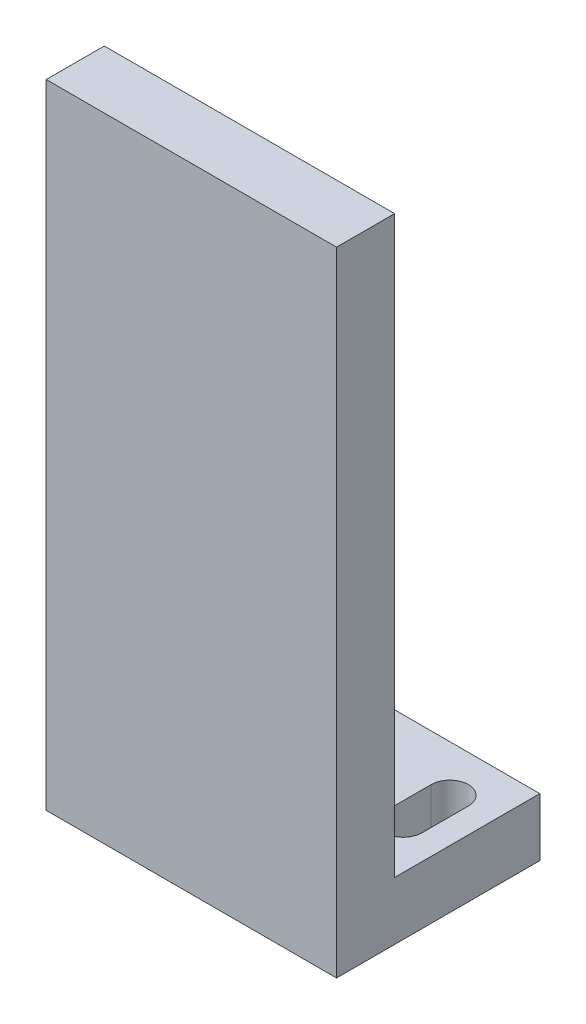
ISO-10303-21;
HEADER;
FILE_DESCRIPTION(('STEP AP214'),'2;1');
FILE_NAME('part.step','',(''),(''),'','','');
FILE_SCHEMA(('AUTOMOTIVE_DESIGN { 1 0 10303 214 1 1 1 1 }'));
ENDSEC;
DATA;
#1=APPLICATION_CONTEXT('core data for automotive mechanical design processes');
#2=APPLICATION_PROTOCOL_DEFINITION('international standard','automotive_design',2000,#1);
#3=PRODUCT_CONTEXT('',#1,'mechanical');
#4=PRODUCT('Part','Part','',(#3));
#5=PRODUCT_RELATED_PRODUCT_CATEGORY('part','',(#4));
#6=PRODUCT_DEFINITION_FORMATION('','',#4);
#7=PRODUCT_DEFINITION_CONTEXT('part definition',#1,'design');
#8=PRODUCT_DEFINITION('design','',#6,#7);
#9=PRODUCT_DEFINITION_SHAPE('','',#8);
#10=(LENGTH_UNIT() NAMED_UNIT(*) SI_UNIT(.MILLI.,.METRE.));
#11=(NAMED_UNIT(*) PLANE_ANGLE_UNIT() SI_UNIT($,.RADIAN.));
#12=(NAMED_UNIT(*) SI_UNIT($,.STERADIAN.) SOLID_ANGLE_UNIT());
#13=UNCERTAINTY_MEASURE_WITH_UNIT(LENGTH_MEASURE(1.E-05),#10,'distance_accuracy_value','');
#14=(GEOMETRIC_REPRESENTATION_CONTEXT(3) GLOBAL_UNCERTAINTY_ASSIGNED_CONTEXT((#13)) GLOBAL_UNIT_ASSIGNED_CONTEXT((#10,
#11,#12)) REPRESENTATION_CONTEXT('',''));
#15=CARTESIAN_POINT('',(0.,0.,0.));
#16=DIRECTION('',(0.,0.,1.));
#17=DIRECTION('',(1.,0.,0.));
#18=AXIS2_PLACEMENT_3D('',#15,#16,#17);
#19=CARTESIAN_POINT('',(25.,109.,-17.5));
#20=DIRECTION('',(0.,0.,1.));
#21=DIRECTION('',(1.,0.,0.));
#22=AXIS2_PLACEMENT_3D('',#19,#20,#21);
#23=PLANE('',#22);
#24=DIRECTION('',(1.,0.,0.));
#25=VECTOR('',#24,1.);
#26=CARTESIAN_POINT('',(-25.,9.99999999999999,-17.5));
#27=LINE('',#26,#25);
#28=CARTESIAN_POINT('',(-25.,9.99999999999999,-17.5));
#29=VERTEX_POINT('',#28);
#30=CARTESIAN_POINT('',(25.,9.99999999999999,-17.5));
#31=VERTEX_POINT('',#30);
#32=EDGE_CURVE('E209',#29,#31,#27,.T.);
#33=ORIENTED_EDGE('',*,*,#32,.T.);
#34=DIRECTION('',(0.,-1.,0.));
#35=VECTOR('',#34,1.);
#36=CARTESIAN_POINT('',(25.,109.,-17.5));
#37=LINE('',#36,#35);
#38=CARTESIAN_POINT('',(25.,0.,-17.5));
#39=VERTEX_POINT('',#38);
#40=EDGE_CURVE('E243',#31,#39,#37,.T.);
#41=ORIENTED_EDGE('',*,*,#40,.T.);
#42=DIRECTION('',(-1.,0.,0.));
#43=VECTOR('',#42,1.);
#44=CARTESIAN_POINT('',(25.,0.,-17.5));
#45=LINE('',#44,#43);
#46=CARTESIAN_POINT('',(-25.,0.,-17.5));
#47=VERTEX_POINT('',#46);
#48=EDGE_CURVE('E227',#39,#47,#45,.T.);
#49=ORIENTED_EDGE('',*,*,#48,.T.);
#50=DIRECTION('',(0.,-1.,0.));
#51=VECTOR('',#50,1.);
#52=CARTESIAN_POINT('',(-25.,109.,-17.5));
#53=LINE('',#52,#51);
#54=EDGE_CURVE('E232',#29,#47,#53,.T.);
#55=ORIENTED_EDGE('',*,*,#54,.F.);
#56=EDGE_LOOP('',(#33,#41,#49,#55));
#57=FACE_BOUND('',#56,.T.);
#58=ADVANCED_FACE('F36',(#57),#23,.F.);
#59=CARTESIAN_POINT('',(-25.,109.,17.5));
#60=DIRECTION('',(1.,0.,0.));
#61=DIRECTION('',(0.,0.,-1.));
#62=AXIS2_PLACEMENT_3D('',#59,#60,#61);
#63=PLANE('',#62);
#64=DIRECTION('',(0.,0.,1.));
#65=VECTOR('',#64,1.);
#66=CARTESIAN_POINT('',(-25.,109.,17.5));
#67=LINE('',#66,#65);
#68=CARTESIAN_POINT('',(-25.,109.,7.5));
#69=VERTEX_POINT('',#68);
#70=CARTESIAN_POINT('',(-25.,109.,17.5));
#71=VERTEX_POINT('',#70);
#72=EDGE_CURVE('E224',#69,#71,#67,.T.);
#73=ORIENTED_EDGE('',*,*,#72,.F.);
#74=DIRECTION('',(0.,1.,0.));
#75=VECTOR('',#74,1.);
#76=CARTESIAN_POINT('',(-25.,-55.9016994374947,7.5));
#77=LINE('',#76,#75);
#78=CARTESIAN_POINT('',(-25.,9.99999999999999,7.5));
#79=VERTEX_POINT('',#78);
#80=EDGE_CURVE('E218',#79,#69,#77,.T.);
#81=ORIENTED_EDGE('',*,*,#80,.F.);
#82=DIRECTION('',(0.,0.,-1.));
#83=VECTOR('',#82,1.);
#84=CARTESIAN_POINT('',(-25.,9.99999999999999,-17.5));
#85=LINE('',#84,#83);
#86=EDGE_CURVE('E213',#79,#29,#85,.T.);
#87=ORIENTED_EDGE('',*,*,#86,.T.);
#88=ORIENTED_EDGE('',*,*,#54,.T.);
#89=DIRECTION('',(0.,0.,1.));
#90=VECTOR('',#89,1.);
#91=CARTESIAN_POINT('',(-25.,0.,17.5));
#92=LINE('',#91,#90);
#93=CARTESIAN_POINT('',(-25.,0.,17.5));
#94=VERTEX_POINT('',#93);
#95=EDGE_CURVE('E223',#47,#94,#92,.T.);
#96=ORIENTED_EDGE('',*,*,#95,.T.);
#97=DIRECTION('',(0.,-1.,0.));
#98=VECTOR('',#97,1.);
#99=CARTESIAN_POINT('',(-25.,109.,17.5));
#100=LINE('',#99,#98);
#101=EDGE_CURVE('E12',#71,#94,#100,.T.);
#102=ORIENTED_EDGE('',*,*,#101,.F.);
#103=EDGE_LOOP('',(#73,#81,#87,#88,#96,#102));
#104=FACE_BOUND('',#103,.T.);
#105=ADVANCED_FACE('F38',(#104),#63,.F.);
#106=CARTESIAN_POINT('',(25.,109.,17.5));
#107=DIRECTION('',(0.,0.,-1.));
#108=DIRECTION('',(-1.,0.,0.));
#109=AXIS2_PLACEMENT_3D('',#106,#107,#108);
#110=PLANE('',#109);
#111=DIRECTION('',(1.,0.,0.));
#112=VECTOR('',#111,1.);
#113=CARTESIAN_POINT('',(25.,0.,17.5));
#114=LINE('',#113,#112);
#115=CARTESIAN_POINT('',(25.,0.,17.5));
#116=VERTEX_POINT('',#115);
#117=EDGE_CURVE('E235',#94,#116,#114,.T.);
#118=ORIENTED_EDGE('',*,*,#117,.T.);
#119=DIRECTION('',(0.,-1.,0.));
#120=VECTOR('',#119,1.);
#121=CARTESIAN_POINT('',(25.,109.,17.5));
#122=LINE('',#121,#120);
#123=CARTESIAN_POINT('',(25.,109.,17.5));
#124=VERTEX_POINT('',#123);
#125=EDGE_CURVE('E44',#124,#116,#122,.T.);
#126=ORIENTED_EDGE('',*,*,#125,.F.);
#127=DIRECTION('',(1.,0.,0.));
#128=VECTOR('',#127,1.);
#129=CARTESIAN_POINT('',(25.,109.,17.5));
#130=LINE('',#129,#128);
#131=EDGE_CURVE('E226',#71,#124,#130,.T.);
#132=ORIENTED_EDGE('',*,*,#131,.F.);
#133=ORIENTED_EDGE('',*,*,#101,.T.);
#134=EDGE_LOOP('',(#118,#126,#132,#133));
#135=FACE_BOUND('',#134,.T.);
#136=ADVANCED_FACE('F271',(#135),#110,.F.);
#137=CARTESIAN_POINT('',(25.,109.,17.5));
#138=DIRECTION('',(-1.,0.,0.));
#139=DIRECTION('',(0.,0.,1.));
#140=AXIS2_PLACEMENT_3D('',#137,#138,#139);
#141=PLANE('',#140);
#142=DIRECTION('',(0.,0.,1.));
#143=VECTOR('',#142,1.);
#144=CARTESIAN_POINT('',(25.,9.99999999999999,-17.5));
#145=LINE('',#144,#143);
#146=CARTESIAN_POINT('',(25.,9.99999999999997,7.50000000000001));
#147=VERTEX_POINT('',#146);
#148=EDGE_CURVE('E206',#31,#147,#145,.T.);
#149=ORIENTED_EDGE('',*,*,#148,.T.);
#150=DIRECTION('',(0.,1.,0.));
#151=VECTOR('',#150,1.);
#152=CARTESIAN_POINT('',(25.,-55.9016994374947,7.50000000000001));
#153=LINE('',#152,#151);
#154=CARTESIAN_POINT('',(25.,109.,7.50000000000001));
#155=VERTEX_POINT('',#154);
#156=EDGE_CURVE('E210',#147,#155,#153,.T.);
#157=ORIENTED_EDGE('',*,*,#156,.T.);
#158=DIRECTION('',(0.,0.,-1.));
#159=VECTOR('',#158,1.);
#160=CARTESIAN_POINT('',(25.,109.,17.5));
#161=LINE('',#160,#159);
#162=EDGE_CURVE('E229',#124,#155,#161,.T.);
#163=ORIENTED_EDGE('',*,*,#162,.F.);
#164=ORIENTED_EDGE('',*,*,#125,.T.);
#165=DIRECTION('',(0.,0.,-1.));
#166=VECTOR('',#165,1.);
#167=CARTESIAN_POINT('',(25.,0.,17.5));
#168=LINE('',#167,#166);
#169=EDGE_CURVE('E237',#116,#39,#168,.T.);
#170=ORIENTED_EDGE('',*,*,#169,.T.);
#171=ORIENTED_EDGE('',*,*,#40,.F.);
#172=EDGE_LOOP('',(#149,#157,#163,#164,#170,#171));
#173=FACE_BOUND('',#172,.T.);
#174=ADVANCED_FACE('F249',(#173),#141,.F.);
#175=CARTESIAN_POINT('',(0.,109.,0.));
#176=DIRECTION('',(0.,1.,0.));
#177=DIRECTION('',(0.,0.,1.));
#178=AXIS2_PLACEMENT_3D('',#175,#176,#177);
#179=PLANE('',#178);
#180=DIRECTION('',(1.,0.,0.));
#181=VECTOR('',#180,1.);
#182=CARTESIAN_POINT('',(-25.,109.,7.5));
#183=LINE('',#182,#181);
#184=EDGE_CURVE('E199',#69,#155,#183,.T.);
#185=ORIENTED_EDGE('',*,*,#184,.F.);
#186=ORIENTED_EDGE('',*,*,#72,.T.);
#187=ORIENTED_EDGE('',*,*,#131,.T.);
#188=ORIENTED_EDGE('',*,*,#162,.T.);
#189=EDGE_LOOP('',(#185,#186,#187,#188));
#190=FACE_BOUND('',#189,.T.);
#191=ADVANCED_FACE('F268',(#190),#179,.T.);
#192=CARTESIAN_POINT('',(0.,0.,0.));
#193=DIRECTION('',(0.,1.,0.));
#194=DIRECTION('',(0.,0.,1.));
#195=AXIS2_PLACEMENT_3D('',#192,#193,#194);
#196=PLANE('',#195);
#197=DIRECTION('',(0.,0.,1.));
#198=VECTOR('',#197,1.);
#199=CARTESIAN_POINT('',(14.3,0.,-1.5));
#200=LINE('',#199,#198);
#201=CARTESIAN_POINT('',(14.3,0.,-9.5));
#202=VERTEX_POINT('',#201);
#203=CARTESIAN_POINT('',(14.3,0.,-1.5));
#204=VERTEX_POINT('',#203);
#205=EDGE_CURVE('E145',#202,#204,#200,.T.);
#206=ORIENTED_EDGE('',*,*,#205,.T.);
#207=CARTESIAN_POINT('',(17.5,0.,-1.5));
#208=DIRECTION('',(0.,1.,0.));
#209=DIRECTION('',(0.,0.,-1.));
#210=AXIS2_PLACEMENT_3D('',#207,#208,#209);
#211=CIRCLE('',#210,3.2);
#212=CARTESIAN_POINT('',(20.7,0.,-1.5));
#213=VERTEX_POINT('',#212);
#214=EDGE_CURVE('E139',#204,#213,#211,.T.);
#215=ORIENTED_EDGE('',*,*,#214,.T.);
#216=DIRECTION('',(0.,0.,-1.));
#217=VECTOR('',#216,1.);
#218=CARTESIAN_POINT('',(20.7,0.,-1.5));
#219=LINE('',#218,#217);
#220=CARTESIAN_POINT('',(20.7,0.,-9.5));
#221=VERTEX_POINT('',#220);
#222=EDGE_CURVE('E148',#213,#221,#219,.T.);
#223=ORIENTED_EDGE('',*,*,#222,.T.);
#224=CARTESIAN_POINT('',(17.5,0.,-9.5));
#225=DIRECTION('',(0.,1.,0.));
#226=DIRECTION('',(0.,0.,-1.));
#227=AXIS2_PLACEMENT_3D('',#224,#225,#226);
#228=CIRCLE('',#227,3.2);
#229=EDGE_CURVE('E51',#221,#202,#228,.T.);
#230=ORIENTED_EDGE('',*,*,#229,.T.);
#231=EDGE_LOOP('',(#206,#215,#223,#230));
#232=FACE_BOUND('',#231,.T.);
#233=DIRECTION('',(0.,0.,1.));
#234=VECTOR('',#233,1.);
#235=CARTESIAN_POINT('',(-20.7,0.,-1.5));
#236=LINE('',#235,#234);
#237=CARTESIAN_POINT('',(-20.7,0.,-9.5));
#238=VERTEX_POINT('',#237);
#239=CARTESIAN_POINT('',(-20.7,0.,-1.5));
#240=VERTEX_POINT('',#239);
#241=EDGE_CURVE('E184',#238,#240,#236,.T.);
#242=ORIENTED_EDGE('',*,*,#241,.T.);
#243=CARTESIAN_POINT('',(-17.5,0.,-1.5));
#244=DIRECTION('',(0.,1.,0.));
#245=DIRECTION('',(0.,0.,1.));
#246=AXIS2_PLACEMENT_3D('',#243,#244,#245);
#247=CIRCLE('',#246,3.2);
#248=CARTESIAN_POINT('',(-14.3,0.,-1.5));
#249=VERTEX_POINT('',#248);
#250=EDGE_CURVE('E174',#240,#249,#247,.T.);
#251=ORIENTED_EDGE('',*,*,#250,.T.);
#252=DIRECTION('',(0.,0.,-1.));
#253=VECTOR('',#252,1.);
#254=CARTESIAN_POINT('',(-14.3,0.,-1.5));
#255=LINE('',#254,#253);
#256=CARTESIAN_POINT('',(-14.3,0.,-9.49999999999999));
#257=VERTEX_POINT('',#256);
#258=EDGE_CURVE('E177',#249,#257,#255,.T.);
#259=ORIENTED_EDGE('',*,*,#258,.T.);
#260=CARTESIAN_POINT('',(-17.5,0.,-9.5));
#261=DIRECTION('',(0.,1.,0.));
#262=DIRECTION('',(0.,0.,1.));
#263=AXIS2_PLACEMENT_3D('',#260,#261,#262);
#264=CIRCLE('',#263,3.2);
#265=EDGE_CURVE('E181',#257,#238,#264,.T.);
#266=ORIENTED_EDGE('',*,*,#265,.T.);
#267=EDGE_LOOP('',(#242,#251,#259,#266));
#268=FACE_BOUND('',#267,.T.);
#269=ORIENTED_EDGE('',*,*,#95,.F.);
#270=ORIENTED_EDGE('',*,*,#48,.F.);
#271=ORIENTED_EDGE('',*,*,#169,.F.);
#272=ORIENTED_EDGE('',*,*,#117,.F.);
#273=EDGE_LOOP('',(#269,#270,#271,#272));
#274=FACE_BOUND('',#273,.T.);
#275=ADVANCED_FACE('F152',(#232,#268,#274),#196,.F.);
#276=CARTESIAN_POINT('',(-25.,-55.9016994374947,7.5));
#277=DIRECTION('',(0.,0.,1.));
#278=DIRECTION('',(1.,0.,0.));
#279=AXIS2_PLACEMENT_3D('',#276,#277,#278);
#280=PLANE('',#279);
#281=DIRECTION('',(-1.,0.,0.));
#282=VECTOR('',#281,1.);
#283=CARTESIAN_POINT('',(-25.,9.99999999999999,7.5));
#284=LINE('',#283,#282);
#285=EDGE_CURVE('E216',#147,#79,#284,.T.);
#286=ORIENTED_EDGE('',*,*,#285,.T.);
#287=ORIENTED_EDGE('',*,*,#80,.T.);
#288=ORIENTED_EDGE('',*,*,#184,.T.);
#289=ORIENTED_EDGE('',*,*,#156,.F.);
#290=EDGE_LOOP('',(#286,#287,#288,#289));
#291=FACE_BOUND('',#290,.T.);
#292=ADVANCED_FACE('F264',(#291),#280,.F.);
#293=CARTESIAN_POINT('',(0.,10.,0.));
#294=DIRECTION('',(0.,1.,0.));
#295=DIRECTION('',(0.,0.,1.));
#296=AXIS2_PLACEMENT_3D('',#293,#294,#295);
#297=PLANE('',#296);
#298=CARTESIAN_POINT('',(17.5,10.,-1.5));
#299=DIRECTION('',(0.,1.,0.));
#300=DIRECTION('',(0.,0.,-1.));
#301=AXIS2_PLACEMENT_3D('',#298,#299,#300);
#302=CIRCLE('',#301,3.2);
#303=CARTESIAN_POINT('',(14.3,10.,-1.5));
#304=VERTEX_POINT('',#303);
#305=CARTESIAN_POINT('',(20.7,10.,-1.5));
#306=VERTEX_POINT('',#305);
#307=EDGE_CURVE('E59',#304,#306,#302,.T.);
#308=ORIENTED_EDGE('',*,*,#307,.F.);
#309=DIRECTION('',(0.,0.,1.));
#310=VECTOR('',#309,1.);
#311=CARTESIAN_POINT('',(14.3,10.,-1.5));
#312=LINE('',#311,#310);
#313=CARTESIAN_POINT('',(14.3,10.,-9.5));
#314=VERTEX_POINT('',#313);
#315=EDGE_CURVE('E155',#314,#304,#312,.T.);
#316=ORIENTED_EDGE('',*,*,#315,.F.);
#317=CARTESIAN_POINT('',(17.5,10.,-9.5));
#318=DIRECTION('',(0.,1.,0.));
#319=DIRECTION('',(0.,0.,-1.));
#320=AXIS2_PLACEMENT_3D('',#317,#318,#319);
#321=CIRCLE('',#320,3.2);
#322=CARTESIAN_POINT('',(20.7,10.,-9.5));
#323=VERTEX_POINT('',#322);
#324=EDGE_CURVE('E158',#323,#314,#321,.T.);
#325=ORIENTED_EDGE('',*,*,#324,.F.);
#326=DIRECTION('',(0.,0.,-1.));
#327=VECTOR('',#326,1.);
#328=CARTESIAN_POINT('',(20.7,10.,-1.5));
#329=LINE('',#328,#327);
#330=EDGE_CURVE('E164',#306,#323,#329,.T.);
#331=ORIENTED_EDGE('',*,*,#330,.F.);
#332=EDGE_LOOP('',(#308,#316,#325,#331));
#333=FACE_BOUND('',#332,.T.);
#334=CARTESIAN_POINT('',(-17.5,10.,-1.5));
#335=DIRECTION('',(0.,1.,0.));
#336=DIRECTION('',(0.,0.,1.));
#337=AXIS2_PLACEMENT_3D('',#334,#335,#336);
#338=CIRCLE('',#337,3.2);
#339=CARTESIAN_POINT('',(-20.7,10.,-1.5));
#340=VERTEX_POINT('',#339);
#341=CARTESIAN_POINT('',(-14.3,10.,-1.5));
#342=VERTEX_POINT('',#341);
#343=EDGE_CURVE('E170',#340,#342,#338,.T.);
#344=ORIENTED_EDGE('',*,*,#343,.F.);
#345=DIRECTION('',(0.,0.,1.));
#346=VECTOR('',#345,1.);
#347=CARTESIAN_POINT('',(-20.7,10.,-1.5));
#348=LINE('',#347,#346);
#349=CARTESIAN_POINT('',(-20.7,10.,-9.5));
#350=VERTEX_POINT('',#349);
#351=EDGE_CURVE('E178',#350,#340,#348,.T.);
#352=ORIENTED_EDGE('',*,*,#351,.F.);
#353=CARTESIAN_POINT('',(-17.5,10.,-9.5));
#354=DIRECTION('',(0.,1.,0.));
#355=DIRECTION('',(0.,0.,1.));
#356=AXIS2_PLACEMENT_3D('',#353,#354,#355);
#357=CIRCLE('',#356,3.2);
#358=CARTESIAN_POINT('',(-14.3,10.,-9.49999999999999));
#359=VERTEX_POINT('',#358);
#360=EDGE_CURVE('E192',#359,#350,#357,.T.);
#361=ORIENTED_EDGE('',*,*,#360,.F.);
#362=DIRECTION('',(0.,0.,-1.));
#363=VECTOR('',#362,1.);
#364=CARTESIAN_POINT('',(-14.3,10.,-1.5));
#365=LINE('',#364,#363);
#366=EDGE_CURVE('E189',#342,#359,#365,.T.);
#367=ORIENTED_EDGE('',*,*,#366,.F.);
#368=EDGE_LOOP('',(#344,#352,#361,#367));
#369=FACE_BOUND('',#368,.T.);
#370=ORIENTED_EDGE('',*,*,#86,.F.);
#371=ORIENTED_EDGE('',*,*,#285,.F.);
#372=ORIENTED_EDGE('',*,*,#148,.F.);
#373=ORIENTED_EDGE('',*,*,#32,.F.);
#374=EDGE_LOOP('',(#370,#371,#372,#373));
#375=FACE_BOUND('',#374,.T.);
#376=ADVANCED_FACE('F261',(#333,#369,#375),#297,.T.);
#377=CARTESIAN_POINT('',(-17.5,0.,-1.5));
#378=DIRECTION('',(0.,1.,0.));
#379=DIRECTION('',(0.,0.,1.));
#380=AXIS2_PLACEMENT_3D('',#377,#378,#379);
#381=CYLINDRICAL_SURFACE('',#380,3.2);
#382=ORIENTED_EDGE('',*,*,#343,.T.);
#383=DIRECTION('',(0.,1.,0.));
#384=VECTOR('',#383,1.);
#385=CARTESIAN_POINT('',(-14.3,0.,-1.5));
#386=LINE('',#385,#384);
#387=EDGE_CURVE('E187',#249,#342,#386,.T.);
#388=ORIENTED_EDGE('',*,*,#387,.F.);
#389=ORIENTED_EDGE('',*,*,#250,.F.);
#390=DIRECTION('',(0.,1.,0.));
#391=VECTOR('',#390,1.);
#392=CARTESIAN_POINT('',(-20.7,0.,-1.5));
#393=LINE('',#392,#391);
#394=EDGE_CURVE('E197',#240,#340,#393,.T.);
#395=ORIENTED_EDGE('',*,*,#394,.T.);
#396=EDGE_LOOP('',(#382,#388,#389,#395));
#397=FACE_BOUND('',#396,.T.);
#398=ADVANCED_FACE('F291',(#397),#381,.F.);
#399=CARTESIAN_POINT('',(-20.7,0.,-1.5));
#400=DIRECTION('',(-1.,0.,0.));
#401=DIRECTION('',(0.,0.,1.));
#402=AXIS2_PLACEMENT_3D('',#399,#400,#401);
#403=PLANE('',#402);
#404=ORIENTED_EDGE('',*,*,#351,.T.);
#405=ORIENTED_EDGE('',*,*,#394,.F.);
#406=ORIENTED_EDGE('',*,*,#241,.F.);
#407=DIRECTION('',(0.,1.,0.));
#408=VECTOR('',#407,1.);
#409=CARTESIAN_POINT('',(-20.7,0.,-9.5));
#410=LINE('',#409,#408);
#411=EDGE_CURVE('E200',#238,#350,#410,.T.);
#412=ORIENTED_EDGE('',*,*,#411,.T.);
#413=EDGE_LOOP('',(#404,#405,#406,#412));
#414=FACE_BOUND('',#413,.T.);
#415=ADVANCED_FACE('F295',(#414),#403,.F.);
#416=CARTESIAN_POINT('',(-17.5,0.,-9.5));
#417=DIRECTION('',(0.,1.,0.));
#418=DIRECTION('',(0.,0.,1.));
#419=AXIS2_PLACEMENT_3D('',#416,#417,#418);
#420=CYLINDRICAL_SURFACE('',#419,3.2);
#421=ORIENTED_EDGE('',*,*,#360,.T.);
#422=ORIENTED_EDGE('',*,*,#411,.F.);
#423=ORIENTED_EDGE('',*,*,#265,.F.);
#424=DIRECTION('',(0.,1.,0.));
#425=VECTOR('',#424,1.);
#426=CARTESIAN_POINT('',(-14.3,0.,-9.49999999999999));
#427=LINE('',#426,#425);
#428=EDGE_CURVE('E202',#257,#359,#427,.T.);
#429=ORIENTED_EDGE('',*,*,#428,.T.);
#430=EDGE_LOOP('',(#421,#422,#423,#429));
#431=FACE_BOUND('',#430,.T.);
#432=ADVANCED_FACE('F300',(#431),#420,.F.);
#433=CARTESIAN_POINT('',(-14.3,0.,-1.5));
#434=DIRECTION('',(1.,0.,0.));
#435=DIRECTION('',(0.,0.,-1.));
#436=AXIS2_PLACEMENT_3D('',#433,#434,#435);
#437=PLANE('',#436);
#438=ORIENTED_EDGE('',*,*,#366,.T.);
#439=ORIENTED_EDGE('',*,*,#428,.F.);
#440=ORIENTED_EDGE('',*,*,#258,.F.);
#441=ORIENTED_EDGE('',*,*,#387,.T.);
#442=EDGE_LOOP('',(#438,#439,#440,#441));
#443=FACE_BOUND('',#442,.T.);
#444=ADVANCED_FACE('F297',(#443),#437,.F.);
#445=CARTESIAN_POINT('',(17.5,0.,-1.5));
#446=DIRECTION('',(0.,1.,0.));
#447=DIRECTION('',(0.,0.,1.));
#448=AXIS2_PLACEMENT_3D('',#445,#446,#447);
#449=CYLINDRICAL_SURFACE('',#448,3.2);
#450=ORIENTED_EDGE('',*,*,#307,.T.);
#451=DIRECTION('',(0.,1.,0.));
#452=VECTOR('',#451,1.);
#453=CARTESIAN_POINT('',(20.7,0.,-1.5));
#454=LINE('',#453,#452);
#455=EDGE_CURVE('E135',#213,#306,#454,.T.);
#456=ORIENTED_EDGE('',*,*,#455,.F.);
#457=ORIENTED_EDGE('',*,*,#214,.F.);
#458=DIRECTION('',(0.,1.,0.));
#459=VECTOR('',#458,1.);
#460=CARTESIAN_POINT('',(14.3,0.,-1.5));
#461=LINE('',#460,#459);
#462=EDGE_CURVE('E168',#204,#304,#461,.T.);
#463=ORIENTED_EDGE('',*,*,#462,.T.);
#464=EDGE_LOOP('',(#450,#456,#457,#463));
#465=FACE_BOUND('',#464,.T.);
#466=ADVANCED_FACE('F137',(#465),#449,.F.);
#467=CARTESIAN_POINT('',(14.3,0.,-1.5));
#468=DIRECTION('',(-1.,0.,0.));
#469=DIRECTION('',(0.,0.,1.));
#470=AXIS2_PLACEMENT_3D('',#467,#468,#469);
#471=PLANE('',#470);
#472=ORIENTED_EDGE('',*,*,#315,.T.);
#473=ORIENTED_EDGE('',*,*,#462,.F.);
#474=ORIENTED_EDGE('',*,*,#205,.F.);
#475=DIRECTION('',(0.,1.,0.));
#476=VECTOR('',#475,1.);
#477=CARTESIAN_POINT('',(14.3,0.,-9.5));
#478=LINE('',#477,#476);
#479=EDGE_CURVE('E171',#202,#314,#478,.T.);
#480=ORIENTED_EDGE('',*,*,#479,.T.);
#481=EDGE_LOOP('',(#472,#473,#474,#480));
#482=FACE_BOUND('',#481,.T.);
#483=ADVANCED_FACE('F310',(#482),#471,.F.);
#484=CARTESIAN_POINT('',(17.5,0.,-9.5));
#485=DIRECTION('',(0.,1.,0.));
#486=DIRECTION('',(0.,0.,1.));
#487=AXIS2_PLACEMENT_3D('',#484,#485,#486);
#488=CYLINDRICAL_SURFACE('',#487,3.2);
#489=ORIENTED_EDGE('',*,*,#324,.T.);
#490=ORIENTED_EDGE('',*,*,#479,.F.);
#491=ORIENTED_EDGE('',*,*,#229,.F.);
#492=DIRECTION('',(0.,1.,0.));
#493=VECTOR('',#492,1.);
#494=CARTESIAN_POINT('',(20.7,0.,-9.5));
#495=LINE('',#494,#493);
#496=EDGE_CURVE('E144',#221,#323,#495,.T.);
#497=ORIENTED_EDGE('',*,*,#496,.T.);
#498=EDGE_LOOP('',(#489,#490,#491,#497));
#499=FACE_BOUND('',#498,.T.);
#500=ADVANCED_FACE('F313',(#499),#488,.F.);
#501=CARTESIAN_POINT('',(20.7,0.,-1.5));
#502=DIRECTION('',(1.,0.,0.));
#503=DIRECTION('',(0.,0.,-1.));
#504=AXIS2_PLACEMENT_3D('',#501,#502,#503);
#505=PLANE('',#504);
#506=ORIENTED_EDGE('',*,*,#330,.T.);
#507=ORIENTED_EDGE('',*,*,#496,.F.);
#508=ORIENTED_EDGE('',*,*,#222,.F.);
#509=ORIENTED_EDGE('',*,*,#455,.T.);
#510=EDGE_LOOP('',(#506,#507,#508,#509));
#511=FACE_BOUND('',#510,.T.);
#512=ADVANCED_FACE('F149',(#511),#505,.F.);
#513=CLOSED_SHELL('',(#58,#105,#136,#174,#191,#275,#292,#376,#398,#415,#432,#444,#466,#483,#500,#512));
#514=MANIFOLD_SOLID_BREP('B2',#513);
#515=ADVANCED_BREP_SHAPE_REPRESENTATION('',(#18,#514),#14);
#516=SHAPE_DEFINITION_REPRESENTATION(#9,#515);
ENDSEC;
END-ISO-10303-21;
